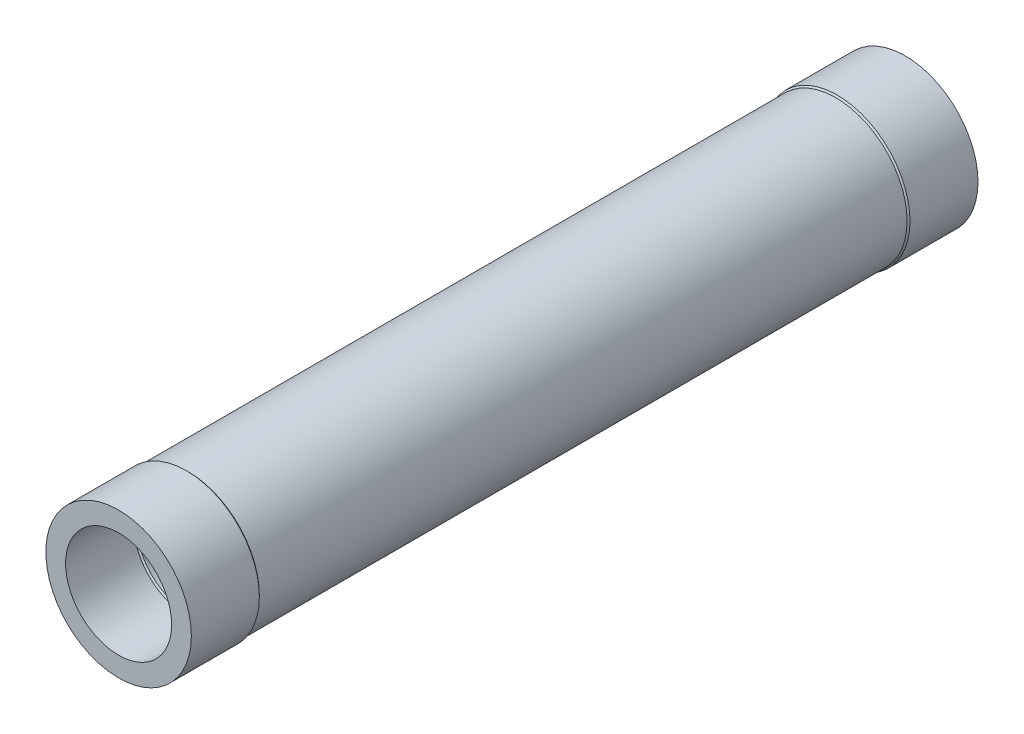
ISO-10303-21;
HEADER;
FILE_DESCRIPTION(('STEP AP214'),'2;1');
FILE_NAME('part.step','',(''),(''),'','','');
FILE_SCHEMA(('AUTOMOTIVE_DESIGN { 1 0 10303 214 1 1 1 1 }'));
ENDSEC;
DATA;
#1=APPLICATION_CONTEXT('core data for automotive mechanical design processes');
#2=APPLICATION_PROTOCOL_DEFINITION('international standard','automotive_design',2000,#1);
#3=PRODUCT_CONTEXT('',#1,'mechanical');
#4=PRODUCT('Part','Part','',(#3));
#5=PRODUCT_RELATED_PRODUCT_CATEGORY('part','',(#4));
#6=PRODUCT_DEFINITION_FORMATION('','',#4);
#7=PRODUCT_DEFINITION_CONTEXT('part definition',#1,'design');
#8=PRODUCT_DEFINITION('design','',#6,#7);
#9=PRODUCT_DEFINITION_SHAPE('','',#8);
#10=(LENGTH_UNIT() NAMED_UNIT(*) SI_UNIT(.MILLI.,.METRE.));
#11=(NAMED_UNIT(*) PLANE_ANGLE_UNIT() SI_UNIT($,.RADIAN.));
#12=(NAMED_UNIT(*) SI_UNIT($,.STERADIAN.) SOLID_ANGLE_UNIT());
#13=UNCERTAINTY_MEASURE_WITH_UNIT(LENGTH_MEASURE(1.E-05),#10,'distance_accuracy_value','');
#14=(GEOMETRIC_REPRESENTATION_CONTEXT(3) GLOBAL_UNCERTAINTY_ASSIGNED_CONTEXT((#13)) GLOBAL_UNIT_ASSIGNED_CONTEXT((#10,
#11,#12)) REPRESENTATION_CONTEXT('',''));
#15=CARTESIAN_POINT('',(0.,0.,0.));
#16=DIRECTION('',(0.,0.,1.));
#17=DIRECTION('',(1.,0.,0.));
#18=AXIS2_PLACEMENT_3D('',#15,#16,#17);
#19=CARTESIAN_POINT('',(0.,0.,-6.943598));
#20=DIRECTION('',(0.,0.,-1.));
#21=DIRECTION('',(-1.,0.,0.));
#22=AXIS2_PLACEMENT_3D('',#19,#20,#21);
#23=PLANE('',#22);
#24=CARTESIAN_POINT('',(0.,0.,-6.943598));
#25=DIRECTION('',(0.,0.,1.));
#26=DIRECTION('',(1.,0.,0.));
#27=AXIS2_PLACEMENT_3D('',#24,#25,#26);
#28=CIRCLE('',#27,0.7747);
#29=CARTESIAN_POINT('',(0.7747,0.,-6.943598));
#30=VERTEX_POINT('',#29);
#31=EDGE_CURVE('E17',#30,#30,#28,.T.);
#32=ORIENTED_EDGE('',*,*,#31,.T.);
#33=EDGE_LOOP('',(#32));
#34=FACE_BOUND('',#33,.T.);
#35=ADVANCED_FACE('F13',(#34),#23,.F.);
#36=CARTESIAN_POINT('',(0.,0.,-19.624802));
#37=DIRECTION('',(0.,0.,-1.));
#38=DIRECTION('',(-1.,0.,0.));
#39=AXIS2_PLACEMENT_3D('',#36,#37,#38);
#40=PLANE('',#39);
#41=CARTESIAN_POINT('',(0.,0.,-19.624802));
#42=DIRECTION('',(0.,0.,1.));
#43=DIRECTION('',(1.,0.,0.));
#44=AXIS2_PLACEMENT_3D('',#41,#42,#43);
#45=CIRCLE('',#44,0.7747);
#46=CARTESIAN_POINT('',(0.7747,0.,-19.624802));
#47=VERTEX_POINT('',#46);
#48=EDGE_CURVE('E70',#47,#47,#45,.F.);
#49=ORIENTED_EDGE('',*,*,#48,.T.);
#50=EDGE_LOOP('',(#49));
#51=FACE_BOUND('',#50,.T.);
#52=ADVANCED_FACE('F82',(#51),#40,.T.);
#53=CARTESIAN_POINT('',(0.,0.,1.36652));
#54=DIRECTION('',(0.,0.,1.));
#55=DIRECTION('',(1.,0.,0.));
#56=AXIS2_PLACEMENT_3D('',#53,#54,#55);
#57=CYLINDRICAL_SURFACE('',#56,0.7747);
#58=ORIENTED_EDGE('',*,*,#31,.F.);
#59=EDGE_LOOP('',(#58));
#60=FACE_BOUND('',#59,.T.);
#61=CARTESIAN_POINT('',(0.,0.,-5.9436));
#62=DIRECTION('',(0.,0.,1.));
#63=DIRECTION('',(1.,0.,0.));
#64=AXIS2_PLACEMENT_3D('',#61,#62,#63);
#65=CIRCLE('',#64,0.7747);
#66=CARTESIAN_POINT('',(0.7747,0.,-5.9436));
#67=VERTEX_POINT('',#66);
#68=EDGE_CURVE('E68',#67,#67,#65,.T.);
#69=ORIENTED_EDGE('',*,*,#68,.T.);
#70=EDGE_LOOP('',(#69));
#71=FACE_BOUND('',#70,.T.);
#72=ADVANCED_FACE('F78',(#60,#71),#57,.F.);
#73=CARTESIAN_POINT('',(0.,0.,1.36652));
#74=DIRECTION('',(0.,0.,1.));
#75=DIRECTION('',(1.,0.,0.));
#76=AXIS2_PLACEMENT_3D('',#73,#74,#75);
#77=CYLINDRICAL_SURFACE('',#76,0.7747);
#78=ORIENTED_EDGE('',*,*,#48,.F.);
#79=EDGE_LOOP('',(#78));
#80=FACE_BOUND('',#79,.T.);
#81=CARTESIAN_POINT('',(0.,0.,-20.6248));
#82=DIRECTION('',(0.,0.,1.));
#83=DIRECTION('',(1.,0.,0.));
#84=AXIS2_PLACEMENT_3D('',#81,#82,#83);
#85=CIRCLE('',#84,0.7747);
#86=CARTESIAN_POINT('',(0.7747,0.,-20.6248));
#87=VERTEX_POINT('',#86);
#88=EDGE_CURVE('E65',#87,#87,#85,.T.);
#89=ORIENTED_EDGE('',*,*,#88,.F.);
#90=EDGE_LOOP('',(#89));
#91=FACE_BOUND('',#90,.T.);
#92=ADVANCED_FACE('F81',(#80,#91),#77,.F.);
#93=CARTESIAN_POINT('',(0.,0.,-5.9436));
#94=DIRECTION('',(0.,0.,-1.));
#95=DIRECTION('',(-1.,0.,0.));
#96=AXIS2_PLACEMENT_3D('',#93,#94,#95);
#97=PLANE('',#96);
#98=ORIENTED_EDGE('',*,*,#68,.F.);
#99=EDGE_LOOP('',(#98));
#100=FACE_BOUND('',#99,.T.);
#101=CARTESIAN_POINT('',(0.,0.,-5.9436));
#102=DIRECTION('',(0.,0.,1.));
#103=DIRECTION('',(1.,0.,0.));
#104=AXIS2_PLACEMENT_3D('',#101,#102,#103);
#105=CIRCLE('',#104,1.7907);
#106=CARTESIAN_POINT('',(1.7907,0.,-5.9436));
#107=VERTEX_POINT('',#106);
#108=EDGE_CURVE('E62',#107,#107,#105,.T.);
#109=ORIENTED_EDGE('',*,*,#108,.T.);
#110=EDGE_LOOP('',(#109));
#111=FACE_BOUND('',#110,.T.);
#112=ADVANCED_FACE('F86',(#100,#111),#97,.F.);
#113=CARTESIAN_POINT('',(0.,0.,-20.6248));
#114=DIRECTION('',(0.,0.,-1.));
#115=DIRECTION('',(-1.,0.,0.));
#116=AXIS2_PLACEMENT_3D('',#113,#114,#115);
#117=PLANE('',#116);
#118=ORIENTED_EDGE('',*,*,#88,.T.);
#119=EDGE_LOOP('',(#118));
#120=FACE_BOUND('',#119,.T.);
#121=CARTESIAN_POINT('',(0.,0.,-20.6248));
#122=DIRECTION('',(0.,0.,1.));
#123=DIRECTION('',(1.,0.,0.));
#124=AXIS2_PLACEMENT_3D('',#121,#122,#123);
#125=CIRCLE('',#124,1.7907);
#126=CARTESIAN_POINT('',(1.7907,0.,-20.6248));
#127=VERTEX_POINT('',#126);
#128=EDGE_CURVE('E49',#127,#127,#125,.F.);
#129=ORIENTED_EDGE('',*,*,#128,.T.);
#130=EDGE_LOOP('',(#129));
#131=FACE_BOUND('',#130,.T.);
#132=ADVANCED_FACE('F89',(#120,#131),#117,.T.);
#133=CARTESIAN_POINT('',(0.,0.,1.36652));
#134=DIRECTION('',(0.,0.,1.));
#135=DIRECTION('',(1.,0.,0.));
#136=AXIS2_PLACEMENT_3D('',#133,#134,#135);
#137=CYLINDRICAL_SURFACE('',#136,1.7907);
#138=CARTESIAN_POINT('',(0.,0.,-2.41300000004685));
#139=DIRECTION('',(0.,0.,1.));
#140=DIRECTION('',(0.,1.,0.));
#141=AXIS2_PLACEMENT_3D('',#138,#139,#140);
#142=CIRCLE('',#141,1.79070000001502);
#143=CARTESIAN_POINT('',(0.,1.79070000001502,-2.41300000004685));
#144=VERTEX_POINT('',#143);
#145=EDGE_CURVE('E46',#144,#144,#142,.T.);
#146=ORIENTED_EDGE('',*,*,#145,.T.);
#147=EDGE_LOOP('',(#146));
#148=FACE_BOUND('',#147,.T.);
#149=ORIENTED_EDGE('',*,*,#108,.F.);
#150=EDGE_LOOP('',(#149));
#151=FACE_BOUND('',#150,.T.);
#152=ADVANCED_FACE('F93',(#148,#151),#137,.F.);
#153=CARTESIAN_POINT('',(0.,0.,1.36652));
#154=DIRECTION('',(0.,0.,1.));
#155=DIRECTION('',(1.,0.,0.));
#156=AXIS2_PLACEMENT_3D('',#153,#154,#155);
#157=CYLINDRICAL_SURFACE('',#156,1.7907);
#158=ORIENTED_EDGE('',*,*,#128,.F.);
#159=EDGE_LOOP('',(#158));
#160=FACE_BOUND('',#159,.T.);
#161=CARTESIAN_POINT('',(0.,0.,-24.9174000000494));
#162=DIRECTION('',(0.,0.,-1.));
#163=DIRECTION('',(0.,-1.,0.));
#164=AXIS2_PLACEMENT_3D('',#161,#162,#163);
#165=CIRCLE('',#164,1.79069999995818);
#166=CARTESIAN_POINT('',(0.,-1.79069999995818,-24.9174000000494));
#167=VERTEX_POINT('',#166);
#168=EDGE_CURVE('E43',#167,#167,#165,.T.);
#169=ORIENTED_EDGE('',*,*,#168,.T.);
#170=EDGE_LOOP('',(#169));
#171=FACE_BOUND('',#170,.T.);
#172=ADVANCED_FACE('F95',(#160,#171),#157,.F.);
#173=CARTESIAN_POINT('',(0.,0.,-2.36219999999321));
#174=DIRECTION('',(0.,0.,1.));
#175=DIRECTION('',(1.,0.,0.));
#176=AXIS2_PLACEMENT_3D('',#173,#174,#175);
#177=CONICAL_SURFACE('',#176,1.84150000001182,0.785398162837966);
#178=ORIENTED_EDGE('',*,*,#145,.F.);
#179=EDGE_LOOP('',(#178));
#180=FACE_BOUND('',#179,.T.);
#181=CARTESIAN_POINT('',(0.,0.,-2.3622));
#182=DIRECTION('',(0.,0.,1.));
#183=DIRECTION('',(1.,0.,0.));
#184=AXIS2_PLACEMENT_3D('',#181,#182,#183);
#185=CIRCLE('',#184,1.8415);
#186=CARTESIAN_POINT('',(1.8415,0.,-2.3622));
#187=VERTEX_POINT('',#186);
#188=EDGE_CURVE('E40',#187,#187,#185,.T.);
#189=ORIENTED_EDGE('',*,*,#188,.T.);
#190=EDGE_LOOP('',(#189));
#191=FACE_BOUND('',#190,.T.);
#192=ADVANCED_FACE('F103',(#180,#191),#177,.F.);
#193=CARTESIAN_POINT('',(0.,0.,-24.9681999999893));
#194=DIRECTION('',(0.,0.,-1.));
#195=DIRECTION('',(-1.,0.,0.));
#196=AXIS2_PLACEMENT_3D('',#193,#194,#195);
#197=CONICAL_SURFACE('',#196,1.84149999989813,0.785398162837966);
#198=ORIENTED_EDGE('',*,*,#168,.F.);
#199=EDGE_LOOP('',(#198));
#200=FACE_BOUND('',#199,.T.);
#201=CARTESIAN_POINT('',(0.,0.,-24.9682));
#202=DIRECTION('',(0.,0.,1.));
#203=DIRECTION('',(1.,0.,0.));
#204=AXIS2_PLACEMENT_3D('',#201,#202,#203);
#205=CIRCLE('',#204,1.8415);
#206=CARTESIAN_POINT('',(1.8415,0.,-24.9682));
#207=VERTEX_POINT('',#206);
#208=EDGE_CURVE('E36',#207,#207,#205,.F.);
#209=ORIENTED_EDGE('',*,*,#208,.T.);
#210=EDGE_LOOP('',(#209));
#211=FACE_BOUND('',#210,.T.);
#212=ADVANCED_FACE('F149',(#200,#211),#197,.F.);
#213=CARTESIAN_POINT('',(0.,0.,1.36652));
#214=DIRECTION('',(0.,0.,1.));
#215=DIRECTION('',(1.,0.,0.));
#216=AXIS2_PLACEMENT_3D('',#213,#214,#215);
#217=CYLINDRICAL_SURFACE('',#216,1.8415);
#218=CARTESIAN_POINT('',(0.,0.,0.));
#219=DIRECTION('',(0.,0.,1.));
#220=DIRECTION('',(1.,0.,0.));
#221=AXIS2_PLACEMENT_3D('',#218,#219,#220);
#222=CIRCLE('',#221,1.8415);
#223=CARTESIAN_POINT('',(1.8415,0.,0.));
#224=VERTEX_POINT('',#223);
#225=EDGE_CURVE('E39',#224,#224,#222,.T.);
#226=ORIENTED_EDGE('',*,*,#225,.T.);
#227=EDGE_LOOP('',(#226));
#228=FACE_BOUND('',#227,.T.);
#229=ORIENTED_EDGE('',*,*,#188,.F.);
#230=EDGE_LOOP('',(#229));
#231=FACE_BOUND('',#230,.T.);
#232=ADVANCED_FACE('F145',(#228,#231),#217,.F.);
#233=CARTESIAN_POINT('',(0.,0.,1.36652));
#234=DIRECTION('',(0.,0.,1.));
#235=DIRECTION('',(1.,0.,0.));
#236=AXIS2_PLACEMENT_3D('',#233,#234,#235);
#237=CYLINDRICAL_SURFACE('',#236,1.8415);
#238=ORIENTED_EDGE('',*,*,#208,.F.);
#239=EDGE_LOOP('',(#238));
#240=FACE_BOUND('',#239,.T.);
#241=CARTESIAN_POINT('',(0.,0.,-27.3304));
#242=DIRECTION('',(0.,0.,1.));
#243=DIRECTION('',(1.,0.,0.));
#244=AXIS2_PLACEMENT_3D('',#241,#242,#243);
#245=CIRCLE('',#244,1.8415);
#246=CARTESIAN_POINT('',(1.8415,0.,-27.3304));
#247=VERTEX_POINT('',#246);
#248=EDGE_CURVE('E55',#247,#247,#245,.T.);
#249=ORIENTED_EDGE('',*,*,#248,.F.);
#250=EDGE_LOOP('',(#249));
#251=FACE_BOUND('',#250,.T.);
#252=ADVANCED_FACE('F141',(#240,#251),#237,.F.);
#253=CARTESIAN_POINT('',(0.,0.,0.));
#254=DIRECTION('',(0.,0.,-1.));
#255=DIRECTION('',(-1.,0.,0.));
#256=AXIS2_PLACEMENT_3D('',#253,#254,#255);
#257=PLANE('',#256);
#258=ORIENTED_EDGE('',*,*,#225,.F.);
#259=EDGE_LOOP('',(#258));
#260=FACE_BOUND('',#259,.T.);
#261=CARTESIAN_POINT('',(0.,0.,0.));
#262=DIRECTION('',(0.,0.,1.));
#263=DIRECTION('',(1.,0.,0.));
#264=AXIS2_PLACEMENT_3D('',#261,#262,#263);
#265=CIRCLE('',#264,2.5273);
#266=CARTESIAN_POINT('',(2.5273,0.,0.));
#267=VERTEX_POINT('',#266);
#268=EDGE_CURVE('E52',#267,#267,#265,.F.);
#269=ORIENTED_EDGE('',*,*,#268,.F.);
#270=EDGE_LOOP('',(#269));
#271=FACE_BOUND('',#270,.T.);
#272=ADVANCED_FACE('F135',(#260,#271),#257,.F.);
#273=CARTESIAN_POINT('',(0.,0.,-27.3304));
#274=DIRECTION('',(0.,0.,-1.));
#275=DIRECTION('',(-1.,0.,0.));
#276=AXIS2_PLACEMENT_3D('',#273,#274,#275);
#277=PLANE('',#276);
#278=ORIENTED_EDGE('',*,*,#248,.T.);
#279=EDGE_LOOP('',(#278));
#280=FACE_BOUND('',#279,.T.);
#281=CARTESIAN_POINT('',(0.,0.,-27.3304));
#282=DIRECTION('',(0.,0.,1.));
#283=DIRECTION('',(1.,0.,0.));
#284=AXIS2_PLACEMENT_3D('',#281,#282,#283);
#285=CIRCLE('',#284,2.5273);
#286=CARTESIAN_POINT('',(2.5273,0.,-27.3304));
#287=VERTEX_POINT('',#286);
#288=EDGE_CURVE('E33',#287,#287,#285,.T.);
#289=ORIENTED_EDGE('',*,*,#288,.F.);
#290=EDGE_LOOP('',(#289));
#291=FACE_BOUND('',#290,.T.);
#292=ADVANCED_FACE('F126',(#280,#291),#277,.T.);
#293=CARTESIAN_POINT('',(0.,0.,1.36652));
#294=DIRECTION('',(0.,0.,1.));
#295=DIRECTION('',(1.,0.,0.));
#296=AXIS2_PLACEMENT_3D('',#293,#294,#295);
#297=CYLINDRICAL_SURFACE('',#296,2.5273);
#298=ORIENTED_EDGE('',*,*,#268,.T.);
#299=EDGE_LOOP('',(#298));
#300=FACE_BOUND('',#299,.T.);
#301=CARTESIAN_POINT('',(0.,0.,-2.36220000005005));
#302=DIRECTION('',(0.,0.,1.));
#303=DIRECTION('',(0.,1.,0.));
#304=AXIS2_PLACEMENT_3D('',#301,#302,#303);
#305=CIRCLE('',#304,2.52729999999701);
#306=CARTESIAN_POINT('',(0.,2.52729999999701,-2.36220000005005));
#307=VERTEX_POINT('',#306);
#308=EDGE_CURVE('E30',#307,#307,#305,.F.);
#309=ORIENTED_EDGE('',*,*,#308,.F.);
#310=EDGE_LOOP('',(#309));
#311=FACE_BOUND('',#310,.T.);
#312=ADVANCED_FACE('F124',(#300,#311),#297,.T.);
#313=CARTESIAN_POINT('',(0.,0.,1.36652));
#314=DIRECTION('',(0.,0.,1.));
#315=DIRECTION('',(1.,0.,0.));
#316=AXIS2_PLACEMENT_3D('',#313,#314,#315);
#317=CYLINDRICAL_SURFACE('',#316,2.5273);
#318=CARTESIAN_POINT('',(0.,0.,-24.9682000000462));
#319=DIRECTION('',(0.,0.,-1.));
#320=DIRECTION('',(0.,-1.,0.));
#321=AXIS2_PLACEMENT_3D('',#318,#319,#320);
#322=CIRCLE('',#321,2.52729999999701);
#323=CARTESIAN_POINT('',(0.,-2.52729999999701,-24.9682000000462));
#324=VERTEX_POINT('',#323);
#325=EDGE_CURVE('E26',#324,#324,#322,.F.);
#326=ORIENTED_EDGE('',*,*,#325,.F.);
#327=EDGE_LOOP('',(#326));
#328=FACE_BOUND('',#327,.T.);
#329=ORIENTED_EDGE('',*,*,#288,.T.);
#330=EDGE_LOOP('',(#329));
#331=FACE_BOUND('',#330,.T.);
#332=ADVANCED_FACE('F120',(#328,#331),#317,.T.);
#333=CARTESIAN_POINT('',(0.,0.,-2.36220000005005));
#334=DIRECTION('',(0.,0.,1.));
#335=DIRECTION('',(1.,0.,0.));
#336=AXIS2_PLACEMENT_3D('',#333,#334,#335);
#337=CONICAL_SURFACE('',#336,2.52729999999701,0.785398163397448);
#338=CARTESIAN_POINT('',(0.,0.,-2.413));
#339=DIRECTION('',(0.,0.,1.));
#340=DIRECTION('',(1.,0.,0.));
#341=AXIS2_PLACEMENT_3D('',#338,#339,#340);
#342=CIRCLE('',#341,2.4765);
#343=CARTESIAN_POINT('',(2.4765,0.,-2.413));
#344=VERTEX_POINT('',#343);
#345=EDGE_CURVE('E21',#344,#344,#342,.F.);
#346=ORIENTED_EDGE('',*,*,#345,.F.);
#347=EDGE_LOOP('',(#346));
#348=FACE_BOUND('',#347,.T.);
#349=ORIENTED_EDGE('',*,*,#308,.T.);
#350=EDGE_LOOP('',(#349));
#351=FACE_BOUND('',#350,.T.);
#352=ADVANCED_FACE('F114',(#348,#351),#337,.T.);
#353=CARTESIAN_POINT('',(0.,0.,-24.9682000000462));
#354=DIRECTION('',(0.,0.,-1.));
#355=DIRECTION('',(-1.,0.,0.));
#356=AXIS2_PLACEMENT_3D('',#353,#354,#355);
#357=CONICAL_SURFACE('',#356,2.52729999999701,0.785398163397448);
#358=ORIENTED_EDGE('',*,*,#325,.T.);
#359=EDGE_LOOP('',(#358));
#360=FACE_BOUND('',#359,.T.);
#361=CARTESIAN_POINT('',(0.,0.,-24.9174));
#362=DIRECTION('',(0.,0.,1.));
#363=DIRECTION('',(1.,0.,0.));
#364=AXIS2_PLACEMENT_3D('',#361,#362,#363);
#365=CIRCLE('',#364,2.4765);
#366=CARTESIAN_POINT('',(2.4765,0.,-24.9174));
#367=VERTEX_POINT('',#366);
#368=EDGE_CURVE('E9',#367,#367,#365,.T.);
#369=ORIENTED_EDGE('',*,*,#368,.F.);
#370=EDGE_LOOP('',(#369));
#371=FACE_BOUND('',#370,.T.);
#372=ADVANCED_FACE('F109',(#360,#371),#357,.T.);
#373=CARTESIAN_POINT('',(0.,0.,1.36652));
#374=DIRECTION('',(0.,0.,1.));
#375=DIRECTION('',(1.,0.,0.));
#376=AXIS2_PLACEMENT_3D('',#373,#374,#375);
#377=CYLINDRICAL_SURFACE('',#376,2.4765);
#378=ORIENTED_EDGE('',*,*,#345,.T.);
#379=EDGE_LOOP('',(#378));
#380=FACE_BOUND('',#379,.T.);
#381=ORIENTED_EDGE('',*,*,#368,.T.);
#382=EDGE_LOOP('',(#381));
#383=FACE_BOUND('',#382,.T.);
#384=ADVANCED_FACE('F15',(#380,#383),#377,.T.);
#385=CLOSED_SHELL('',(#35,#52,#72,#92,#112,#132,#152,#172,#192,#212,#232,#252,#272,#292,#312,
#332,#352,#372,#384));
#386=MANIFOLD_SOLID_BREP('B1',#385);
#387=ADVANCED_BREP_SHAPE_REPRESENTATION('',(#18,#386),#14);
#388=SHAPE_DEFINITION_REPRESENTATION(#9,#387);
ENDSEC;
END-ISO-10303-21;
